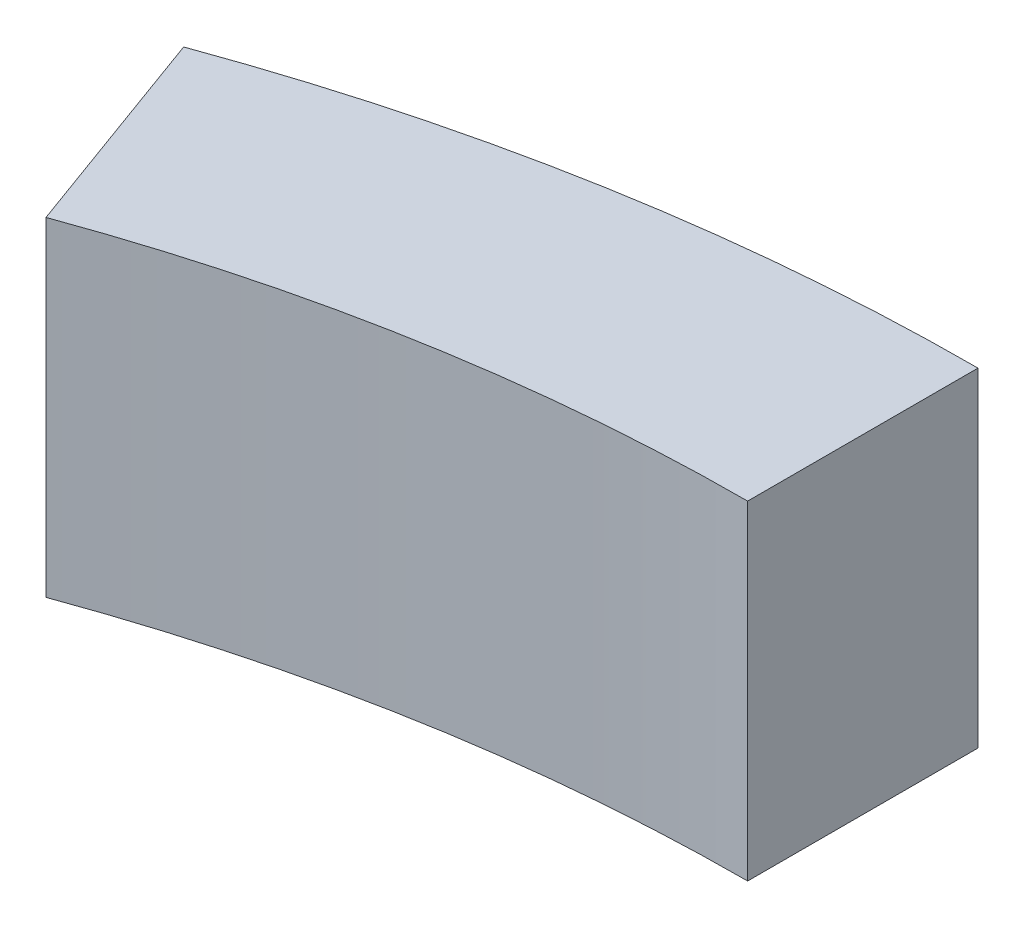
ISO-10303-21;
HEADER;
FILE_DESCRIPTION(('STEP AP214'),'2;1');
FILE_NAME('part.step','',(''),(''),'','','');
FILE_SCHEMA(('AUTOMOTIVE_DESIGN { 1 0 10303 214 1 1 1 1 }'));
ENDSEC;
DATA;
#1=APPLICATION_CONTEXT('core data for automotive mechanical design processes');
#2=APPLICATION_PROTOCOL_DEFINITION('international standard','automotive_design',2000,#1);
#3=PRODUCT_CONTEXT('',#1,'mechanical');
#4=PRODUCT('Part','Part','',(#3));
#5=PRODUCT_RELATED_PRODUCT_CATEGORY('part','',(#4));
#6=PRODUCT_DEFINITION_FORMATION('','',#4);
#7=PRODUCT_DEFINITION_CONTEXT('part definition',#1,'design');
#8=PRODUCT_DEFINITION('design','',#6,#7);
#9=PRODUCT_DEFINITION_SHAPE('','',#8);
#10=(LENGTH_UNIT() NAMED_UNIT(*) SI_UNIT(.MILLI.,.METRE.));
#11=(NAMED_UNIT(*) PLANE_ANGLE_UNIT() SI_UNIT($,.RADIAN.));
#12=(NAMED_UNIT(*) SI_UNIT($,.STERADIAN.) SOLID_ANGLE_UNIT());
#13=UNCERTAINTY_MEASURE_WITH_UNIT(LENGTH_MEASURE(1.E-05),#10,'distance_accuracy_value','');
#14=(GEOMETRIC_REPRESENTATION_CONTEXT(3) GLOBAL_UNCERTAINTY_ASSIGNED_CONTEXT((#13)) GLOBAL_UNIT_ASSIGNED_CONTEXT((#10,
#11,#12)) REPRESENTATION_CONTEXT('',''));
#15=CARTESIAN_POINT('',(0.,0.,0.));
#16=DIRECTION('',(0.,0.,1.));
#17=DIRECTION('',(1.,0.,0.));
#18=AXIS2_PLACEMENT_3D('',#15,#16,#17);
#19=CARTESIAN_POINT('',(0.,10.,0.));
#20=DIRECTION('',(0.,-1.,0.));
#21=DIRECTION('',(0.,0.,-1.));
#22=AXIS2_PLACEMENT_3D('',#19,#20,#21);
#23=CYLINDRICAL_SURFACE('',#22,60.);
#24=CARTESIAN_POINT('',(0.,0.,0.));
#25=DIRECTION('',(0.,1.,0.));
#26=DIRECTION('',(0.,0.,-1.));
#27=AXIS2_PLACEMENT_3D('',#24,#25,#26);
#28=CIRCLE('',#27,60.);
#29=CARTESIAN_POINT('',(0.,0.,-60.));
#30=VERTEX_POINT('',#29);
#31=CARTESIAN_POINT('',(-20.5212085995398,0.,-56.3815572471546));
#32=VERTEX_POINT('',#31);
#33=EDGE_CURVE('E97',#30,#32,#28,.T.);
#34=ORIENTED_EDGE('',*,*,#33,.T.);
#35=DIRECTION('',(0.,-1.,0.));
#36=VECTOR('',#35,1.);
#37=CARTESIAN_POINT('',(-20.5212085995398,10.,-56.3815572471546));
#38=LINE('',#37,#36);
#39=CARTESIAN_POINT('',(-20.5212085995398,10.,-56.3815572471546));
#40=VERTEX_POINT('',#39);
#41=EDGE_CURVE('E11',#40,#32,#38,.T.);
#42=ORIENTED_EDGE('',*,*,#41,.F.);
#43=CARTESIAN_POINT('',(0.,10.,0.));
#44=DIRECTION('',(0.,1.,0.));
#45=DIRECTION('',(0.,0.,-1.));
#46=AXIS2_PLACEMENT_3D('',#43,#44,#45);
#47=CIRCLE('',#46,60.);
#48=CARTESIAN_POINT('',(0.,10.,-60.));
#49=VERTEX_POINT('',#48);
#50=EDGE_CURVE('E85',#49,#40,#47,.T.);
#51=ORIENTED_EDGE('',*,*,#50,.F.);
#52=DIRECTION('',(0.,-1.,0.));
#53=VECTOR('',#52,1.);
#54=CARTESIAN_POINT('',(0.,10.,-60.));
#55=LINE('',#54,#53);
#56=EDGE_CURVE('E93',#49,#30,#55,.T.);
#57=ORIENTED_EDGE('',*,*,#56,.T.);
#58=EDGE_LOOP('',(#34,#42,#51,#57));
#59=FACE_BOUND('',#58,.T.);
#60=ADVANCED_FACE('F34',(#59),#23,.T.);
#61=CARTESIAN_POINT('',(-20.5212085995398,10.,-56.3815572471546));
#62=DIRECTION('',(0.93969262078591,0.,-0.342020143325663));
#63=DIRECTION('',(-0.342020143325663,0.,-0.939692620785911));
#64=AXIS2_PLACEMENT_3D('',#61,#62,#63);
#65=PLANE('',#64);
#66=DIRECTION('',(0.342020143325663,0.,0.93969262078591));
#67=VECTOR('',#66,1.);
#68=CARTESIAN_POINT('',(-20.5212085995398,0.,-56.3815572471546));
#69=LINE('',#68,#67);
#70=CARTESIAN_POINT('',(-18.1270675962601,0.,-49.8037089016532));
#71=VERTEX_POINT('',#70);
#72=EDGE_CURVE('E89',#32,#71,#69,.T.);
#73=ORIENTED_EDGE('',*,*,#72,.T.);
#74=DIRECTION('',(0.,-1.,0.));
#75=VECTOR('',#74,1.);
#76=CARTESIAN_POINT('',(-18.1270675962601,10.,-49.8037089016532));
#77=LINE('',#76,#75);
#78=CARTESIAN_POINT('',(-18.1270675962601,10.,-49.8037089016532));
#79=VERTEX_POINT('',#78);
#80=EDGE_CURVE('E42',#79,#71,#77,.T.);
#81=ORIENTED_EDGE('',*,*,#80,.F.);
#82=DIRECTION('',(0.342020143325663,0.,0.93969262078591));
#83=VECTOR('',#82,1.);
#84=CARTESIAN_POINT('',(-20.5212085995398,10.,-56.3815572471546));
#85=LINE('',#84,#83);
#86=EDGE_CURVE('E80',#40,#79,#85,.T.);
#87=ORIENTED_EDGE('',*,*,#86,.F.);
#88=ORIENTED_EDGE('',*,*,#41,.T.);
#89=EDGE_LOOP('',(#73,#81,#87,#88));
#90=FACE_BOUND('',#89,.T.);
#91=ADVANCED_FACE('F88',(#90),#65,.F.);
#92=CARTESIAN_POINT('',(0.,10.,0.));
#93=DIRECTION('',(0.,-1.,0.));
#94=DIRECTION('',(0.,0.,-1.));
#95=AXIS2_PLACEMENT_3D('',#92,#93,#94);
#96=CYLINDRICAL_SURFACE('',#95,53.);
#97=CARTESIAN_POINT('',(0.,0.,0.));
#98=DIRECTION('',(0.,-1.,0.));
#99=DIRECTION('',(0.,0.,-1.));
#100=AXIS2_PLACEMENT_3D('',#97,#98,#99);
#101=CIRCLE('',#100,53.);
#102=CARTESIAN_POINT('',(0.,0.,-53.));
#103=VERTEX_POINT('',#102);
#104=EDGE_CURVE('E67',#71,#103,#101,.T.);
#105=ORIENTED_EDGE('',*,*,#104,.T.);
#106=DIRECTION('',(0.,-1.,0.));
#107=VECTOR('',#106,1.);
#108=CARTESIAN_POINT('',(0.,10.,-53.));
#109=LINE('',#108,#107);
#110=CARTESIAN_POINT('',(0.,10.,-53.));
#111=VERTEX_POINT('',#110);
#112=EDGE_CURVE('E90',#111,#103,#109,.T.);
#113=ORIENTED_EDGE('',*,*,#112,.F.);
#114=CARTESIAN_POINT('',(0.,10.,0.));
#115=DIRECTION('',(0.,-1.,0.));
#116=DIRECTION('',(0.,0.,-1.));
#117=AXIS2_PLACEMENT_3D('',#114,#115,#116);
#118=CIRCLE('',#117,53.);
#119=EDGE_CURVE('E83',#79,#111,#118,.T.);
#120=ORIENTED_EDGE('',*,*,#119,.F.);
#121=ORIENTED_EDGE('',*,*,#80,.T.);
#122=EDGE_LOOP('',(#105,#113,#120,#121));
#123=FACE_BOUND('',#122,.T.);
#124=ADVANCED_FACE('F91',(#123),#96,.F.);
#125=CARTESIAN_POINT('',(0.,10.,-53.));
#126=DIRECTION('',(-1.,0.,0.));
#127=DIRECTION('',(0.,0.,1.));
#128=AXIS2_PLACEMENT_3D('',#125,#126,#127);
#129=PLANE('',#128);
#130=DIRECTION('',(0.,0.,-1.));
#131=VECTOR('',#130,1.);
#132=CARTESIAN_POINT('',(0.,0.,-53.));
#133=LINE('',#132,#131);
#134=EDGE_CURVE('E73',#103,#30,#133,.T.);
#135=ORIENTED_EDGE('',*,*,#134,.T.);
#136=ORIENTED_EDGE('',*,*,#56,.F.);
#137=DIRECTION('',(0.,0.,-1.));
#138=VECTOR('',#137,1.);
#139=CARTESIAN_POINT('',(0.,10.,-53.));
#140=LINE('',#139,#138);
#141=EDGE_CURVE('E50',#111,#49,#140,.T.);
#142=ORIENTED_EDGE('',*,*,#141,.F.);
#143=ORIENTED_EDGE('',*,*,#112,.T.);
#144=EDGE_LOOP('',(#135,#136,#142,#143));
#145=FACE_BOUND('',#144,.T.);
#146=ADVANCED_FACE('F104',(#145),#129,.F.);
#147=CARTESIAN_POINT('',(0.,10.,0.));
#148=DIRECTION('',(0.,-1.,0.));
#149=DIRECTION('',(0.,0.,-1.));
#150=AXIS2_PLACEMENT_3D('',#147,#148,#149);
#151=PLANE('',#150);
#152=ORIENTED_EDGE('',*,*,#50,.T.);
#153=ORIENTED_EDGE('',*,*,#86,.T.);
#154=ORIENTED_EDGE('',*,*,#119,.T.);
#155=ORIENTED_EDGE('',*,*,#141,.T.);
#156=EDGE_LOOP('',(#152,#153,#154,#155));
#157=FACE_BOUND('',#156,.T.);
#158=ADVANCED_FACE('F81',(#157),#151,.F.);
#159=CARTESIAN_POINT('',(0.,0.,0.));
#160=DIRECTION('',(0.,-1.,0.));
#161=DIRECTION('',(0.,0.,-1.));
#162=AXIS2_PLACEMENT_3D('',#159,#160,#161);
#163=PLANE('',#162);
#164=ORIENTED_EDGE('',*,*,#33,.F.);
#165=ORIENTED_EDGE('',*,*,#134,.F.);
#166=ORIENTED_EDGE('',*,*,#104,.F.);
#167=ORIENTED_EDGE('',*,*,#72,.F.);
#168=EDGE_LOOP('',(#164,#165,#166,#167));
#169=FACE_BOUND('',#168,.T.);
#170=ADVANCED_FACE('F107',(#169),#163,.T.);
#171=CLOSED_SHELL('',(#60,#91,#124,#146,#158,#170));
#172=MANIFOLD_SOLID_BREP('B2',#171);
#173=ADVANCED_BREP_SHAPE_REPRESENTATION('',(#18,#172),#14);
#174=SHAPE_DEFINITION_REPRESENTATION(#9,#173);
ENDSEC;
END-ISO-10303-21;
